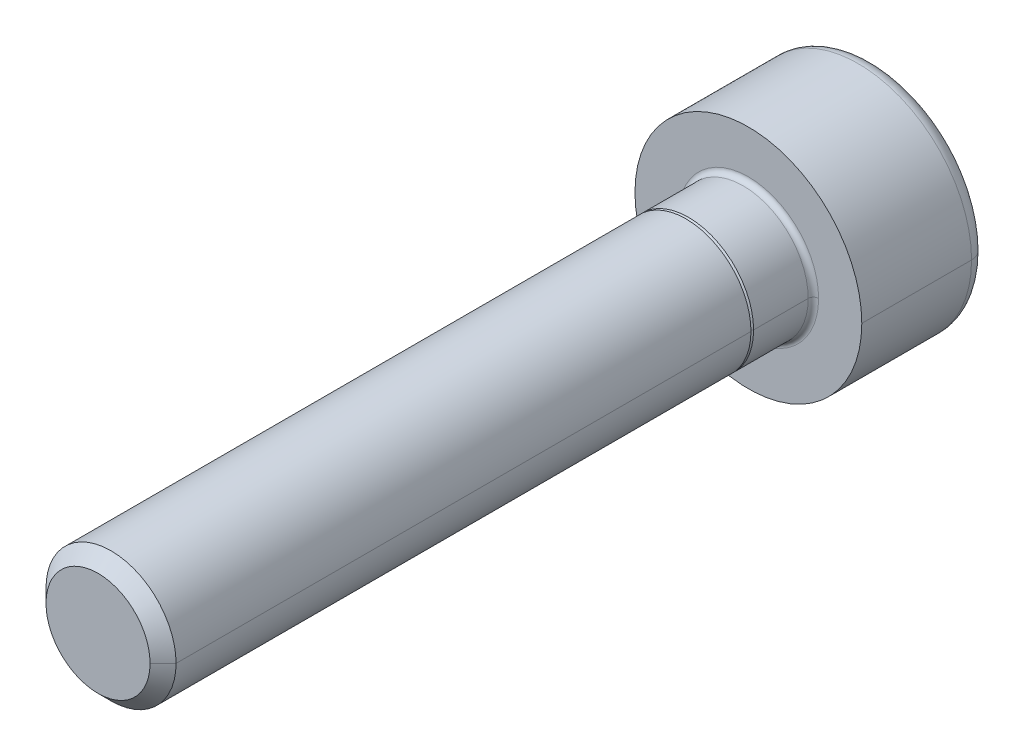
ISO-10303-21;
HEADER;
FILE_DESCRIPTION(('STEP AP214'),'2;1');
FILE_NAME('part.step','',(''),(''),'','','');
FILE_SCHEMA(('AUTOMOTIVE_DESIGN { 1 0 10303 214 1 1 1 1 }'));
ENDSEC;
DATA;
#1=APPLICATION_CONTEXT('core data for automotive mechanical design processes');
#2=APPLICATION_PROTOCOL_DEFINITION('international standard','automotive_design',2000,#1);
#3=PRODUCT_CONTEXT('',#1,'mechanical');
#4=PRODUCT('Part','Part','',(#3));
#5=PRODUCT_RELATED_PRODUCT_CATEGORY('part','',(#4));
#6=PRODUCT_DEFINITION_FORMATION('','',#4);
#7=PRODUCT_DEFINITION_CONTEXT('part definition',#1,'design');
#8=PRODUCT_DEFINITION('design','',#6,#7);
#9=PRODUCT_DEFINITION_SHAPE('','',#8);
#10=(LENGTH_UNIT() NAMED_UNIT(*) SI_UNIT(.MILLI.,.METRE.));
#11=(NAMED_UNIT(*) PLANE_ANGLE_UNIT() SI_UNIT($,.RADIAN.));
#12=(NAMED_UNIT(*) SI_UNIT($,.STERADIAN.) SOLID_ANGLE_UNIT());
#13=UNCERTAINTY_MEASURE_WITH_UNIT(LENGTH_MEASURE(1.E-05),#10,'distance_accuracy_value','');
#14=(GEOMETRIC_REPRESENTATION_CONTEXT(3) GLOBAL_UNCERTAINTY_ASSIGNED_CONTEXT((#13)) GLOBAL_UNIT_ASSIGNED_CONTEXT((#10,
#11,#12)) REPRESENTATION_CONTEXT('',''));
#15=CARTESIAN_POINT('',(0.,0.,0.));
#16=DIRECTION('',(0.,0.,1.));
#17=DIRECTION('',(1.,0.,0.));
#18=AXIS2_PLACEMENT_3D('',#15,#16,#17);
#19=CARTESIAN_POINT('',(0.,0.,-4.22));
#20=DIRECTION('',(0.,0.,1.));
#21=DIRECTION('',(1.,0.,0.));
#22=AXIS2_PLACEMENT_3D('',#19,#20,#21);
#23=TOROIDAL_SURFACE('',#22,3.76,0.6);
#24=CARTESIAN_POINT('',(-3.76,0.,-4.22));
#25=DIRECTION('',(0.,1.,0.));
#26=DIRECTION('',(-1.,0.,0.));
#27=AXIS2_PLACEMENT_3D('',#24,#25,#26);
#28=CIRCLE('',#27,0.6);
#29=CARTESIAN_POINT('',(-3.76,0.,-4.82));
#30=VERTEX_POINT('',#29);
#31=CARTESIAN_POINT('',(-4.36,0.,-4.22));
#32=VERTEX_POINT('',#31);
#33=EDGE_CURVE('E181',#30,#32,#28,.T.);
#34=ORIENTED_EDGE('',*,*,#33,.F.);
#35=CARTESIAN_POINT('',(0.,0.,-4.82));
#36=DIRECTION('',(0.,0.,-1.));
#37=DIRECTION('',(1.,0.,0.));
#38=AXIS2_PLACEMENT_3D('',#35,#36,#37);
#39=CIRCLE('',#38,3.76);
#40=CARTESIAN_POINT('',(3.76,0.,-4.82));
#41=VERTEX_POINT('',#40);
#42=EDGE_CURVE('E168',#41,#30,#39,.T.);
#43=ORIENTED_EDGE('',*,*,#42,.F.);
#44=CARTESIAN_POINT('',(3.76,0.,-4.22));
#45=DIRECTION('',(0.,-1.,0.));
#46=DIRECTION('',(0.,0.,-1.));
#47=AXIS2_PLACEMENT_3D('',#44,#45,#46);
#48=CIRCLE('',#47,0.6);
#49=CARTESIAN_POINT('',(4.36,0.,-4.22));
#50=VERTEX_POINT('',#49);
#51=EDGE_CURVE('E190',#41,#50,#48,.T.);
#52=ORIENTED_EDGE('',*,*,#51,.T.);
#53=CARTESIAN_POINT('',(0.,0.,-4.22));
#54=DIRECTION('',(0.,0.,1.));
#55=DIRECTION('',(1.,0.,0.));
#56=AXIS2_PLACEMENT_3D('',#53,#54,#55);
#57=CIRCLE('',#56,4.36);
#58=EDGE_CURVE('E182',#32,#50,#57,.T.);
#59=ORIENTED_EDGE('',*,*,#58,.F.);
#60=EDGE_LOOP('',(#34,#43,#52,#59));
#61=FACE_BOUND('',#60,.T.);
#62=ADVANCED_FACE('F17',(#61),#23,.T.);
#63=CARTESIAN_POINT('',(0.,0.,0.2));
#64=DIRECTION('',(0.,0.,1.));
#65=DIRECTION('',(1.,0.,0.));
#66=AXIS2_PLACEMENT_3D('',#63,#64,#65);
#67=TOROIDAL_SURFACE('',#66,2.7,0.2);
#68=CARTESIAN_POINT('',(-2.7,0.,0.2));
#69=DIRECTION('',(0.,1.,0.));
#70=DIRECTION('',(-1.,0.,0.));
#71=AXIS2_PLACEMENT_3D('',#68,#69,#70);
#72=CIRCLE('',#71,0.2);
#73=CARTESIAN_POINT('',(-2.5,0.,0.2));
#74=VERTEX_POINT('',#73);
#75=CARTESIAN_POINT('',(-2.7,0.,0.));
#76=VERTEX_POINT('',#75);
#77=EDGE_CURVE('E239',#74,#76,#72,.T.);
#78=ORIENTED_EDGE('',*,*,#77,.F.);
#79=CARTESIAN_POINT('',(0.,0.,0.2));
#80=DIRECTION('',(0.,0.,1.));
#81=DIRECTION('',(1.,0.,0.));
#82=AXIS2_PLACEMENT_3D('',#79,#80,#81);
#83=CIRCLE('',#82,2.5);
#84=CARTESIAN_POINT('',(2.5,0.,0.2));
#85=VERTEX_POINT('',#84);
#86=EDGE_CURVE('E254',#85,#74,#83,.T.);
#87=ORIENTED_EDGE('',*,*,#86,.F.);
#88=CARTESIAN_POINT('',(2.7,0.,0.2));
#89=DIRECTION('',(0.,-1.,0.));
#90=DIRECTION('',(0.,0.,-1.));
#91=AXIS2_PLACEMENT_3D('',#88,#89,#90);
#92=CIRCLE('',#91,0.2);
#93=CARTESIAN_POINT('',(2.7,0.,0.));
#94=VERTEX_POINT('',#93);
#95=EDGE_CURVE('E214',#85,#94,#92,.T.);
#96=ORIENTED_EDGE('',*,*,#95,.T.);
#97=CARTESIAN_POINT('',(0.,0.,0.));
#98=DIRECTION('',(0.,0.,-1.));
#99=DIRECTION('',(1.,0.,0.));
#100=AXIS2_PLACEMENT_3D('',#97,#98,#99);
#101=CIRCLE('',#100,2.7);
#102=EDGE_CURVE('E330',#76,#94,#101,.T.);
#103=ORIENTED_EDGE('',*,*,#102,.F.);
#104=EDGE_LOOP('',(#78,#87,#96,#103));
#105=FACE_BOUND('',#104,.T.);
#106=ADVANCED_FACE('F390',(#105),#67,.F.);
#107=CARTESIAN_POINT('',(0.,0.,25.));
#108=DIRECTION('',(0.,0.,-1.));
#109=DIRECTION('',(-1.,0.,0.));
#110=AXIS2_PLACEMENT_3D('',#107,#108,#109);
#111=CONICAL_SURFACE('',#110,2.,0.785398163397442);
#112=DIRECTION('',(0.707106781186544,0.,-0.707106781186552));
#113=VECTOR('',#112,1.);
#114=CARTESIAN_POINT('',(2.,0.,25.));
#115=LINE('',#114,#113);
#116=CARTESIAN_POINT('',(2.,0.,25.));
#117=VERTEX_POINT('',#116);
#118=CARTESIAN_POINT('',(2.5,0.,24.5));
#119=VERTEX_POINT('',#118);
#120=EDGE_CURVE('E229',#117,#119,#115,.T.);
#121=ORIENTED_EDGE('',*,*,#120,.F.);
#122=CARTESIAN_POINT('',(0.,0.,25.));
#123=DIRECTION('',(0.,0.,1.));
#124=DIRECTION('',(1.,0.,0.));
#125=AXIS2_PLACEMENT_3D('',#122,#123,#124);
#126=CIRCLE('',#125,2.);
#127=CARTESIAN_POINT('',(-2.,0.,25.));
#128=VERTEX_POINT('',#127);
#129=EDGE_CURVE('E11',#128,#117,#126,.T.);
#130=ORIENTED_EDGE('',*,*,#129,.F.);
#131=DIRECTION('',(-0.707106781186544,0.,-0.707106781186552));
#132=VECTOR('',#131,1.);
#133=CARTESIAN_POINT('',(-2.,0.,25.));
#134=LINE('',#133,#132);
#135=CARTESIAN_POINT('',(-2.5,0.,24.5));
#136=VERTEX_POINT('',#135);
#137=EDGE_CURVE('E199',#128,#136,#134,.T.);
#138=ORIENTED_EDGE('',*,*,#137,.T.);
#139=CARTESIAN_POINT('',(0.,0.,24.5));
#140=DIRECTION('',(0.,0.,-1.));
#141=DIRECTION('',(1.,0.,0.));
#142=AXIS2_PLACEMENT_3D('',#139,#140,#141);
#143=CIRCLE('',#142,2.5);
#144=EDGE_CURVE('E353',#119,#136,#143,.T.);
#145=ORIENTED_EDGE('',*,*,#144,.F.);
#146=EDGE_LOOP('',(#121,#130,#138,#145));
#147=FACE_BOUND('',#146,.T.);
#148=ADVANCED_FACE('F375',(#147),#111,.T.);
#149=CARTESIAN_POINT('',(0.,0.,2.4));
#150=DIRECTION('',(0.,0.,1.));
#151=DIRECTION('',(1.,0.,0.));
#152=AXIS2_PLACEMENT_3D('',#149,#150,#151);
#153=PLANE('',#152);
#154=CARTESIAN_POINT('',(0.,0.,2.4));
#155=DIRECTION('',(0.,0.,1.));
#156=DIRECTION('',(1.,0.,0.));
#157=AXIS2_PLACEMENT_3D('',#154,#155,#156);
#158=CIRCLE('',#157,2.4);
#159=CARTESIAN_POINT('',(-2.4,0.,2.4));
#160=VERTEX_POINT('',#159);
#161=CARTESIAN_POINT('',(2.4,0.,2.4));
#162=VERTEX_POINT('',#161);
#163=EDGE_CURVE('E283',#160,#162,#158,.T.);
#164=ORIENTED_EDGE('',*,*,#163,.T.);
#165=CARTESIAN_POINT('',(0.,0.,2.4));
#166=DIRECTION('',(0.,0.,1.));
#167=DIRECTION('',(1.,0.,0.));
#168=AXIS2_PLACEMENT_3D('',#165,#166,#167);
#169=CIRCLE('',#168,2.4);
#170=EDGE_CURVE('E249',#162,#160,#169,.T.);
#171=ORIENTED_EDGE('',*,*,#170,.T.);
#172=EDGE_LOOP('',(#164,#171));
#173=FACE_BOUND('',#172,.T.);
#174=CARTESIAN_POINT('',(0.,0.,2.4));
#175=DIRECTION('',(0.,0.,1.));
#176=DIRECTION('',(1.,0.,0.));
#177=AXIS2_PLACEMENT_3D('',#174,#175,#176);
#178=CIRCLE('',#177,2.5);
#179=CARTESIAN_POINT('',(-2.5,0.,2.4));
#180=VERTEX_POINT('',#179);
#181=CARTESIAN_POINT('',(2.5,0.,2.4));
#182=VERTEX_POINT('',#181);
#183=EDGE_CURVE('E25',#180,#182,#178,.T.);
#184=ORIENTED_EDGE('',*,*,#183,.F.);
#185=CARTESIAN_POINT('',(0.,0.,2.4));
#186=DIRECTION('',(0.,0.,1.));
#187=DIRECTION('',(1.,0.,0.));
#188=AXIS2_PLACEMENT_3D('',#185,#186,#187);
#189=CIRCLE('',#188,2.5);
#190=EDGE_CURVE('E210',#182,#180,#189,.T.);
#191=ORIENTED_EDGE('',*,*,#190,.F.);
#192=EDGE_LOOP('',(#184,#191));
#193=FACE_BOUND('',#192,.T.);
#194=ADVANCED_FACE('F365',(#173,#193),#153,.F.);
#195=CARTESIAN_POINT('',(0.,0.,25.));
#196=DIRECTION('',(0.,0.,1.));
#197=DIRECTION('',(1.,0.,0.));
#198=AXIS2_PLACEMENT_3D('',#195,#196,#197);
#199=PLANE('',#198);
#200=ORIENTED_EDGE('',*,*,#129,.T.);
#201=CARTESIAN_POINT('',(0.,0.,25.));
#202=DIRECTION('',(0.,0.,1.));
#203=DIRECTION('',(1.,0.,0.));
#204=AXIS2_PLACEMENT_3D('',#201,#202,#203);
#205=CIRCLE('',#204,2.);
#206=EDGE_CURVE('E218',#117,#128,#205,.T.);
#207=ORIENTED_EDGE('',*,*,#206,.T.);
#208=EDGE_LOOP('',(#200,#207));
#209=FACE_BOUND('',#208,.T.);
#210=ADVANCED_FACE('F377',(#209),#199,.T.);
#211=CARTESIAN_POINT('',(0.,0.,25.));
#212=DIRECTION('',(0.,0.,-1.));
#213=DIRECTION('',(-1.,0.,0.));
#214=AXIS2_PLACEMENT_3D('',#211,#212,#213);
#215=CYLINDRICAL_SURFACE('',#214,2.5);
#216=DIRECTION('',(0.,0.,-1.));
#217=VECTOR('',#216,1.);
#218=CARTESIAN_POINT('',(2.5,0.,25.));
#219=LINE('',#218,#217);
#220=EDGE_CURVE('E203',#119,#182,#219,.T.);
#221=ORIENTED_EDGE('',*,*,#220,.F.);
#222=ORIENTED_EDGE('',*,*,#144,.T.);
#223=DIRECTION('',(0.,0.,-1.));
#224=VECTOR('',#223,1.);
#225=CARTESIAN_POINT('',(-2.5,0.,25.));
#226=LINE('',#225,#224);
#227=EDGE_CURVE('E197',#136,#180,#226,.T.);
#228=ORIENTED_EDGE('',*,*,#227,.T.);
#229=ORIENTED_EDGE('',*,*,#183,.T.);
#230=EDGE_LOOP('',(#221,#222,#228,#229));
#231=FACE_BOUND('',#230,.T.);
#232=ADVANCED_FACE('F362',(#231),#215,.T.);
#233=CARTESIAN_POINT('',(0.,0.,2.4));
#234=DIRECTION('',(0.,0.,-1.));
#235=DIRECTION('',(-1.,0.,0.));
#236=AXIS2_PLACEMENT_3D('',#233,#234,#235);
#237=CONICAL_SURFACE('',#236,2.4,0.785398163397442);
#238=DIRECTION('',(0.707106781186543,0.,-0.707106781186552));
#239=VECTOR('',#238,1.);
#240=CARTESIAN_POINT('',(2.4,0.,2.4));
#241=LINE('',#240,#239);
#242=CARTESIAN_POINT('',(2.5,0.,2.3));
#243=VERTEX_POINT('',#242);
#244=EDGE_CURVE('E253',#162,#243,#241,.T.);
#245=ORIENTED_EDGE('',*,*,#244,.F.);
#246=ORIENTED_EDGE('',*,*,#163,.F.);
#247=DIRECTION('',(-0.707106781186543,0.,-0.707106781186552));
#248=VECTOR('',#247,1.);
#249=CARTESIAN_POINT('',(-2.4,0.,2.4));
#250=LINE('',#249,#248);
#251=CARTESIAN_POINT('',(-2.5,0.,2.3));
#252=VERTEX_POINT('',#251);
#253=EDGE_CURVE('E267',#160,#252,#250,.T.);
#254=ORIENTED_EDGE('',*,*,#253,.T.);
#255=CARTESIAN_POINT('',(0.,0.,2.3));
#256=DIRECTION('',(0.,0.,-1.));
#257=DIRECTION('',(1.,0.,0.));
#258=AXIS2_PLACEMENT_3D('',#255,#256,#257);
#259=CIRCLE('',#258,2.5);
#260=EDGE_CURVE('E280',#243,#252,#259,.T.);
#261=ORIENTED_EDGE('',*,*,#260,.F.);
#262=EDGE_LOOP('',(#245,#246,#254,#261));
#263=FACE_BOUND('',#262,.T.);
#264=ADVANCED_FACE('F385',(#263),#237,.T.);
#265=CARTESIAN_POINT('',(0.,0.,2.4));
#266=DIRECTION('',(0.,0.,-1.));
#267=DIRECTION('',(-1.,0.,0.));
#268=AXIS2_PLACEMENT_3D('',#265,#266,#267);
#269=CYLINDRICAL_SURFACE('',#268,2.5);
#270=DIRECTION('',(0.,0.,-1.));
#271=VECTOR('',#270,1.);
#272=CARTESIAN_POINT('',(2.5,0.,2.4));
#273=LINE('',#272,#271);
#274=EDGE_CURVE('E259',#243,#85,#273,.T.);
#275=ORIENTED_EDGE('',*,*,#274,.F.);
#276=ORIENTED_EDGE('',*,*,#260,.T.);
#277=DIRECTION('',(0.,0.,-1.));
#278=VECTOR('',#277,1.);
#279=CARTESIAN_POINT('',(-2.5,0.,2.4));
#280=LINE('',#279,#278);
#281=EDGE_CURVE('E258',#252,#74,#280,.T.);
#282=ORIENTED_EDGE('',*,*,#281,.T.);
#283=CARTESIAN_POINT('',(0.,0.,0.2));
#284=DIRECTION('',(0.,0.,1.));
#285=DIRECTION('',(1.,0.,0.));
#286=AXIS2_PLACEMENT_3D('',#283,#284,#285);
#287=CIRCLE('',#286,2.5);
#288=EDGE_CURVE('E225',#74,#85,#287,.T.);
#289=ORIENTED_EDGE('',*,*,#288,.T.);
#290=EDGE_LOOP('',(#275,#276,#282,#289));
#291=FACE_BOUND('',#290,.T.);
#292=ADVANCED_FACE('F407',(#291),#269,.T.);
#293=CARTESIAN_POINT('',(0.,0.,-2.32));
#294=DIRECTION('',(0.,0.,-1.));
#295=DIRECTION('',(0.,-1.,0.));
#296=AXIS2_PLACEMENT_3D('',#293,#294,#295);
#297=PLANE('',#296);
#298=DIRECTION('',(-0.5,-0.866025403784439,0.));
#299=VECTOR('',#298,1.);
#300=CARTESIAN_POINT('',(2.64426423288849,0.,-2.32));
#301=LINE('',#300,#299);
#302=CARTESIAN_POINT('',(2.64426423288849,0.,-2.32));
#303=VERTEX_POINT('',#302);
#304=CARTESIAN_POINT('',(1.32213211644424,-2.29,-2.32));
#305=VERTEX_POINT('',#304);
#306=EDGE_CURVE('E209',#303,#305,#301,.T.);
#307=ORIENTED_EDGE('',*,*,#306,.T.);
#308=DIRECTION('',(-1.,0.,0.));
#309=VECTOR('',#308,1.);
#310=CARTESIAN_POINT('',(1.32213211644424,-2.29,-2.32));
#311=LINE('',#310,#309);
#312=CARTESIAN_POINT('',(-1.32213211644424,-2.29,-2.32));
#313=VERTEX_POINT('',#312);
#314=EDGE_CURVE('E38',#305,#313,#311,.T.);
#315=ORIENTED_EDGE('',*,*,#314,.T.);
#316=DIRECTION('',(-0.5,0.866025403784439,0.));
#317=VECTOR('',#316,1.);
#318=CARTESIAN_POINT('',(-1.32213211644424,-2.29,-2.32));
#319=LINE('',#318,#317);
#320=CARTESIAN_POINT('',(-2.64426423288848,0.,-2.32));
#321=VERTEX_POINT('',#320);
#322=EDGE_CURVE('E46',#313,#321,#319,.T.);
#323=ORIENTED_EDGE('',*,*,#322,.T.);
#324=DIRECTION('',(0.5,0.866025403784438,0.));
#325=VECTOR('',#324,1.);
#326=CARTESIAN_POINT('',(-2.64426423288848,0.,-2.32));
#327=LINE('',#326,#325);
#328=CARTESIAN_POINT('',(-1.32213211644424,2.29,-2.32));
#329=VERTEX_POINT('',#328);
#330=EDGE_CURVE('E318',#321,#329,#327,.T.);
#331=ORIENTED_EDGE('',*,*,#330,.T.);
#332=DIRECTION('',(1.,0.,0.));
#333=VECTOR('',#332,1.);
#334=CARTESIAN_POINT('',(-1.32213211644424,2.29,-2.32));
#335=LINE('',#334,#333);
#336=CARTESIAN_POINT('',(1.32213211644425,2.29,-2.32));
#337=VERTEX_POINT('',#336);
#338=EDGE_CURVE('E322',#329,#337,#335,.T.);
#339=ORIENTED_EDGE('',*,*,#338,.T.);
#340=DIRECTION('',(0.5,-0.866025403784439,0.));
#341=VECTOR('',#340,1.);
#342=CARTESIAN_POINT('',(1.32213211644425,2.29,-2.32));
#343=LINE('',#342,#341);
#344=EDGE_CURVE('E208',#337,#303,#343,.T.);
#345=ORIENTED_EDGE('',*,*,#344,.T.);
#346=EDGE_LOOP('',(#307,#315,#323,#331,#339,#345));
#347=FACE_BOUND('',#346,.T.);
#348=ADVANCED_FACE('F423',(#347),#297,.T.);
#349=CARTESIAN_POINT('',(1.32213211644424,-2.29,-2.32));
#350=DIRECTION('',(0.,-1.,0.));
#351=DIRECTION('',(-1.,0.,0.));
#352=AXIS2_PLACEMENT_3D('',#349,#350,#351);
#353=PLANE('',#352);
#354=DIRECTION('',(-1.,0.,0.));
#355=VECTOR('',#354,1.);
#356=CARTESIAN_POINT('',(1.32213211644424,-2.29,-4.82));
#357=LINE('',#356,#355);
#358=CARTESIAN_POINT('',(1.32213211644424,-2.29,-4.82));
#359=VERTEX_POINT('',#358);
#360=CARTESIAN_POINT('',(-1.32213211644424,-2.29,-4.82));
#361=VERTEX_POINT('',#360);
#362=EDGE_CURVE('E177',#359,#361,#357,.T.);
#363=ORIENTED_EDGE('',*,*,#362,.T.);
#364=DIRECTION('',(0.,0.,-1.));
#365=VECTOR('',#364,1.);
#366=CARTESIAN_POINT('',(-1.32213211644424,-2.29,-2.32));
#367=LINE('',#366,#365);
#368=EDGE_CURVE('E346',#313,#361,#367,.T.);
#369=ORIENTED_EDGE('',*,*,#368,.F.);
#370=ORIENTED_EDGE('',*,*,#314,.F.);
#371=DIRECTION('',(0.,0.,-1.));
#372=VECTOR('',#371,1.);
#373=CARTESIAN_POINT('',(1.32213211644424,-2.29,-2.32));
#374=LINE('',#373,#372);
#375=EDGE_CURVE('E333',#305,#359,#374,.T.);
#376=ORIENTED_EDGE('',*,*,#375,.T.);
#377=EDGE_LOOP('',(#363,#369,#370,#376));
#378=FACE_BOUND('',#377,.T.);
#379=ADVANCED_FACE('F428',(#378),#353,.F.);
#380=CARTESIAN_POINT('',(-1.32213211644424,-2.29,-2.32));
#381=DIRECTION('',(-0.866025403784439,-0.5,0.));
#382=DIRECTION('',(-0.5,0.866025403784439,0.));
#383=AXIS2_PLACEMENT_3D('',#380,#381,#382);
#384=PLANE('',#383);
#385=DIRECTION('',(-0.5,0.866025403784439,0.));
#386=VECTOR('',#385,1.);
#387=CARTESIAN_POINT('',(-1.32213211644424,-2.29,-4.82));
#388=LINE('',#387,#386);
#389=CARTESIAN_POINT('',(-2.64426423288848,0.,-4.82));
#390=VERTEX_POINT('',#389);
#391=EDGE_CURVE('E326',#361,#390,#388,.T.);
#392=ORIENTED_EDGE('',*,*,#391,.T.);
#393=DIRECTION('',(0.,0.,-1.));
#394=VECTOR('',#393,1.);
#395=CARTESIAN_POINT('',(-2.64426423288848,0.,-2.32));
#396=LINE('',#395,#394);
#397=EDGE_CURVE('E315',#321,#390,#396,.T.);
#398=ORIENTED_EDGE('',*,*,#397,.F.);
#399=ORIENTED_EDGE('',*,*,#322,.F.);
#400=ORIENTED_EDGE('',*,*,#368,.T.);
#401=EDGE_LOOP('',(#392,#398,#399,#400));
#402=FACE_BOUND('',#401,.T.);
#403=ADVANCED_FACE('F431',(#402),#384,.F.);
#404=CARTESIAN_POINT('',(-2.64426423288848,0.,-2.32));
#405=DIRECTION('',(-0.866025403784438,0.5,0.));
#406=DIRECTION('',(0.,0.,1.));
#407=AXIS2_PLACEMENT_3D('',#404,#405,#406);
#408=PLANE('',#407);
#409=DIRECTION('',(0.5,0.866025403784438,0.));
#410=VECTOR('',#409,1.);
#411=CARTESIAN_POINT('',(-2.64426423288848,0.,-4.82));
#412=LINE('',#411,#410);
#413=CARTESIAN_POINT('',(-1.32213211644424,2.29,-4.82));
#414=VERTEX_POINT('',#413);
#415=EDGE_CURVE('E288',#390,#414,#412,.T.);
#416=ORIENTED_EDGE('',*,*,#415,.T.);
#417=DIRECTION('',(0.,0.,-1.));
#418=VECTOR('',#417,1.);
#419=CARTESIAN_POINT('',(-1.32213211644424,2.29,-2.32));
#420=LINE('',#419,#418);
#421=EDGE_CURVE('E319',#329,#414,#420,.T.);
#422=ORIENTED_EDGE('',*,*,#421,.F.);
#423=ORIENTED_EDGE('',*,*,#330,.F.);
#424=ORIENTED_EDGE('',*,*,#397,.T.);
#425=EDGE_LOOP('',(#416,#422,#423,#424));
#426=FACE_BOUND('',#425,.T.);
#427=ADVANCED_FACE('F435',(#426),#408,.F.);
#428=CARTESIAN_POINT('',(-1.32213211644424,2.29,-2.32));
#429=DIRECTION('',(0.,1.,0.));
#430=DIRECTION('',(1.,0.,0.));
#431=AXIS2_PLACEMENT_3D('',#428,#429,#430);
#432=PLANE('',#431);
#433=DIRECTION('',(1.,0.,0.));
#434=VECTOR('',#433,1.);
#435=CARTESIAN_POINT('',(-1.32213211644424,2.29,-4.82));
#436=LINE('',#435,#434);
#437=CARTESIAN_POINT('',(1.32213211644425,2.29,-4.82));
#438=VERTEX_POINT('',#437);
#439=EDGE_CURVE('E284',#414,#438,#436,.T.);
#440=ORIENTED_EDGE('',*,*,#439,.T.);
#441=DIRECTION('',(0.,0.,-1.));
#442=VECTOR('',#441,1.);
#443=CARTESIAN_POINT('',(1.32213211644425,2.29,-2.32));
#444=LINE('',#443,#442);
#445=EDGE_CURVE('E273',#337,#438,#444,.T.);
#446=ORIENTED_EDGE('',*,*,#445,.F.);
#447=ORIENTED_EDGE('',*,*,#338,.F.);
#448=ORIENTED_EDGE('',*,*,#421,.T.);
#449=EDGE_LOOP('',(#440,#446,#447,#448));
#450=FACE_BOUND('',#449,.T.);
#451=ADVANCED_FACE('F441',(#450),#432,.F.);
#452=CARTESIAN_POINT('',(1.32213211644425,2.29,-2.32));
#453=DIRECTION('',(0.866025403784439,0.5,0.));
#454=DIRECTION('',(0.,0.,-1.));
#455=AXIS2_PLACEMENT_3D('',#452,#453,#454);
#456=PLANE('',#455);
#457=DIRECTION('',(0.5,-0.866025403784439,0.));
#458=VECTOR('',#457,1.);
#459=CARTESIAN_POINT('',(1.32213211644425,2.29,-4.82));
#460=LINE('',#459,#458);
#461=CARTESIAN_POINT('',(2.64426423288849,0.,-4.82));
#462=VERTEX_POINT('',#461);
#463=EDGE_CURVE('E289',#438,#462,#460,.T.);
#464=ORIENTED_EDGE('',*,*,#463,.T.);
#465=DIRECTION('',(0.,0.,-1.));
#466=VECTOR('',#465,1.);
#467=CARTESIAN_POINT('',(2.64426423288849,0.,-2.32));
#468=LINE('',#467,#466);
#469=EDGE_CURVE('E205',#303,#462,#468,.T.);
#470=ORIENTED_EDGE('',*,*,#469,.F.);
#471=ORIENTED_EDGE('',*,*,#344,.F.);
#472=ORIENTED_EDGE('',*,*,#445,.T.);
#473=EDGE_LOOP('',(#464,#470,#471,#472));
#474=FACE_BOUND('',#473,.T.);
#475=ADVANCED_FACE('F437',(#474),#456,.F.);
#476=CARTESIAN_POINT('',(2.64426423288849,0.,-2.32));
#477=DIRECTION('',(0.866025403784439,-0.5,0.));
#478=DIRECTION('',(0.,0.,-1.));
#479=AXIS2_PLACEMENT_3D('',#476,#477,#478);
#480=PLANE('',#479);
#481=DIRECTION('',(-0.5,-0.866025403784439,0.));
#482=VECTOR('',#481,1.);
#483=CARTESIAN_POINT('',(2.64426423288849,0.,-4.82));
#484=LINE('',#483,#482);
#485=EDGE_CURVE('E308',#462,#359,#484,.T.);
#486=ORIENTED_EDGE('',*,*,#485,.T.);
#487=ORIENTED_EDGE('',*,*,#375,.F.);
#488=ORIENTED_EDGE('',*,*,#306,.F.);
#489=ORIENTED_EDGE('',*,*,#469,.T.);
#490=EDGE_LOOP('',(#486,#487,#488,#489));
#491=FACE_BOUND('',#490,.T.);
#492=ADVANCED_FACE('F440',(#491),#480,.F.);
#493=CARTESIAN_POINT('',(0.,0.,0.));
#494=DIRECTION('',(0.,0.,1.));
#495=DIRECTION('',(1.,0.,0.));
#496=AXIS2_PLACEMENT_3D('',#493,#494,#495);
#497=PLANE('',#496);
#498=CARTESIAN_POINT('',(0.,0.,0.));
#499=DIRECTION('',(0.,0.,-1.));
#500=DIRECTION('',(1.,0.,0.));
#501=AXIS2_PLACEMENT_3D('',#498,#499,#500);
#502=CIRCLE('',#501,2.7);
#503=EDGE_CURVE('E219',#94,#76,#502,.T.);
#504=ORIENTED_EDGE('',*,*,#503,.T.);
#505=ORIENTED_EDGE('',*,*,#102,.T.);
#506=EDGE_LOOP('',(#504,#505));
#507=FACE_BOUND('',#506,.T.);
#508=CARTESIAN_POINT('',(0.,0.,0.));
#509=DIRECTION('',(0.,0.,1.));
#510=DIRECTION('',(1.,0.,0.));
#511=AXIS2_PLACEMENT_3D('',#508,#509,#510);
#512=CIRCLE('',#511,4.36);
#513=CARTESIAN_POINT('',(4.36,0.,0.));
#514=VERTEX_POINT('',#513);
#515=CARTESIAN_POINT('',(-4.36,0.,0.));
#516=VERTEX_POINT('',#515);
#517=EDGE_CURVE('E293',#514,#516,#512,.T.);
#518=ORIENTED_EDGE('',*,*,#517,.T.);
#519=CARTESIAN_POINT('',(0.,0.,0.));
#520=DIRECTION('',(0.,0.,1.));
#521=DIRECTION('',(1.,0.,0.));
#522=AXIS2_PLACEMENT_3D('',#519,#520,#521);
#523=CIRCLE('',#522,4.36);
#524=EDGE_CURVE('E178',#516,#514,#523,.T.);
#525=ORIENTED_EDGE('',*,*,#524,.T.);
#526=EDGE_LOOP('',(#518,#525));
#527=FACE_BOUND('',#526,.T.);
#528=ADVANCED_FACE('F443',(#507,#527),#497,.T.);
#529=CARTESIAN_POINT('',(0.,0.,-4.82));
#530=DIRECTION('',(0.,0.,1.));
#531=DIRECTION('',(1.,0.,0.));
#532=AXIS2_PLACEMENT_3D('',#529,#530,#531);
#533=PLANE('',#532);
#534=ORIENTED_EDGE('',*,*,#362,.F.);
#535=ORIENTED_EDGE('',*,*,#485,.F.);
#536=ORIENTED_EDGE('',*,*,#463,.F.);
#537=ORIENTED_EDGE('',*,*,#439,.F.);
#538=ORIENTED_EDGE('',*,*,#415,.F.);
#539=ORIENTED_EDGE('',*,*,#391,.F.);
#540=EDGE_LOOP('',(#534,#535,#536,#537,#538,#539));
#541=FACE_BOUND('',#540,.T.);
#542=ORIENTED_EDGE('',*,*,#42,.T.);
#543=CARTESIAN_POINT('',(0.,0.,-4.82));
#544=DIRECTION('',(0.,0.,-1.));
#545=DIRECTION('',(1.,0.,0.));
#546=AXIS2_PLACEMENT_3D('',#543,#544,#545);
#547=CIRCLE('',#546,3.76);
#548=EDGE_CURVE('E172',#30,#41,#547,.T.);
#549=ORIENTED_EDGE('',*,*,#548,.T.);
#550=EDGE_LOOP('',(#542,#549));
#551=FACE_BOUND('',#550,.T.);
#552=ADVANCED_FACE('F170',(#541,#551),#533,.F.);
#553=CARTESIAN_POINT('',(0.,0.,-4.82));
#554=DIRECTION('',(0.,0.,1.));
#555=DIRECTION('',(1.,0.,0.));
#556=AXIS2_PLACEMENT_3D('',#553,#554,#555);
#557=CYLINDRICAL_SURFACE('',#556,4.36);
#558=DIRECTION('',(0.,0.,1.));
#559=VECTOR('',#558,1.);
#560=CARTESIAN_POINT('',(-4.36,0.,-4.82));
#561=LINE('',#560,#559);
#562=EDGE_CURVE('E279',#32,#516,#561,.T.);
#563=ORIENTED_EDGE('',*,*,#562,.F.);
#564=ORIENTED_EDGE('',*,*,#58,.T.);
#565=DIRECTION('',(0.,0.,1.));
#566=VECTOR('',#565,1.);
#567=CARTESIAN_POINT('',(4.36,0.,-4.82));
#568=LINE('',#567,#566);
#569=EDGE_CURVE('E297',#50,#514,#568,.T.);
#570=ORIENTED_EDGE('',*,*,#569,.T.);
#571=ORIENTED_EDGE('',*,*,#524,.F.);
#572=EDGE_LOOP('',(#563,#564,#570,#571));
#573=FACE_BOUND('',#572,.T.);
#574=ADVANCED_FACE('F450',(#573),#557,.T.);
#575=CARTESIAN_POINT('',(0.,0.,-4.82));
#576=DIRECTION('',(0.,0.,1.));
#577=DIRECTION('',(1.,0.,0.));
#578=AXIS2_PLACEMENT_3D('',#575,#576,#577);
#579=CYLINDRICAL_SURFACE('',#578,4.36);
#580=CARTESIAN_POINT('',(0.,0.,-4.22));
#581=DIRECTION('',(0.,0.,1.));
#582=DIRECTION('',(1.,0.,0.));
#583=AXIS2_PLACEMENT_3D('',#580,#581,#582);
#584=CIRCLE('',#583,4.36);
#585=EDGE_CURVE('E187',#50,#32,#584,.T.);
#586=ORIENTED_EDGE('',*,*,#585,.T.);
#587=ORIENTED_EDGE('',*,*,#562,.T.);
#588=ORIENTED_EDGE('',*,*,#517,.F.);
#589=ORIENTED_EDGE('',*,*,#569,.F.);
#590=EDGE_LOOP('',(#586,#587,#588,#589));
#591=FACE_BOUND('',#590,.T.);
#592=ADVANCED_FACE('F453',(#591),#579,.T.);
#593=CARTESIAN_POINT('',(0.,0.,2.4));
#594=DIRECTION('',(0.,0.,-1.));
#595=DIRECTION('',(-1.,0.,0.));
#596=AXIS2_PLACEMENT_3D('',#593,#594,#595);
#597=CYLINDRICAL_SURFACE('',#596,2.5);
#598=CARTESIAN_POINT('',(0.,0.,2.3));
#599=DIRECTION('',(0.,0.,-1.));
#600=DIRECTION('',(1.,0.,0.));
#601=AXIS2_PLACEMENT_3D('',#598,#599,#600);
#602=CIRCLE('',#601,2.5);
#603=EDGE_CURVE('E263',#252,#243,#602,.T.);
#604=ORIENTED_EDGE('',*,*,#603,.T.);
#605=ORIENTED_EDGE('',*,*,#274,.T.);
#606=ORIENTED_EDGE('',*,*,#86,.T.);
#607=ORIENTED_EDGE('',*,*,#281,.F.);
#608=EDGE_LOOP('',(#604,#605,#606,#607));
#609=FACE_BOUND('',#608,.T.);
#610=ADVANCED_FACE('F410',(#609),#597,.T.);
#611=CARTESIAN_POINT('',(0.,0.,2.4));
#612=DIRECTION('',(0.,0.,-1.));
#613=DIRECTION('',(-1.,0.,0.));
#614=AXIS2_PLACEMENT_3D('',#611,#612,#613);
#615=CONICAL_SURFACE('',#614,2.4,0.785398163397442);
#616=ORIENTED_EDGE('',*,*,#170,.F.);
#617=ORIENTED_EDGE('',*,*,#244,.T.);
#618=ORIENTED_EDGE('',*,*,#603,.F.);
#619=ORIENTED_EDGE('',*,*,#253,.F.);
#620=EDGE_LOOP('',(#616,#617,#618,#619));
#621=FACE_BOUND('',#620,.T.);
#622=ADVANCED_FACE('F416',(#621),#615,.T.);
#623=CARTESIAN_POINT('',(0.,0.,25.));
#624=DIRECTION('',(0.,0.,-1.));
#625=DIRECTION('',(-1.,0.,0.));
#626=AXIS2_PLACEMENT_3D('',#623,#624,#625);
#627=CYLINDRICAL_SURFACE('',#626,2.5);
#628=CARTESIAN_POINT('',(0.,0.,24.5));
#629=DIRECTION('',(0.,0.,-1.));
#630=DIRECTION('',(1.,0.,0.));
#631=AXIS2_PLACEMENT_3D('',#628,#629,#630);
#632=CIRCLE('',#631,2.5);
#633=EDGE_CURVE('E204',#136,#119,#632,.T.);
#634=ORIENTED_EDGE('',*,*,#633,.T.);
#635=ORIENTED_EDGE('',*,*,#220,.T.);
#636=ORIENTED_EDGE('',*,*,#190,.T.);
#637=ORIENTED_EDGE('',*,*,#227,.F.);
#638=EDGE_LOOP('',(#634,#635,#636,#637));
#639=FACE_BOUND('',#638,.T.);
#640=ADVANCED_FACE('F367',(#639),#627,.T.);
#641=CARTESIAN_POINT('',(0.,0.,25.));
#642=DIRECTION('',(0.,0.,-1.));
#643=DIRECTION('',(-1.,0.,0.));
#644=AXIS2_PLACEMENT_3D('',#641,#642,#643);
#645=CONICAL_SURFACE('',#644,2.,0.785398163397442);
#646=ORIENTED_EDGE('',*,*,#206,.F.);
#647=ORIENTED_EDGE('',*,*,#120,.T.);
#648=ORIENTED_EDGE('',*,*,#633,.F.);
#649=ORIENTED_EDGE('',*,*,#137,.F.);
#650=EDGE_LOOP('',(#646,#647,#648,#649));
#651=FACE_BOUND('',#650,.T.);
#652=ADVANCED_FACE('F373',(#651),#645,.T.);
#653=CARTESIAN_POINT('',(0.,0.,0.2));
#654=DIRECTION('',(0.,0.,1.));
#655=DIRECTION('',(1.,0.,0.));
#656=AXIS2_PLACEMENT_3D('',#653,#654,#655);
#657=TOROIDAL_SURFACE('',#656,2.7,0.2);
#658=ORIENTED_EDGE('',*,*,#288,.F.);
#659=ORIENTED_EDGE('',*,*,#77,.T.);
#660=ORIENTED_EDGE('',*,*,#503,.F.);
#661=ORIENTED_EDGE('',*,*,#95,.F.);
#662=EDGE_LOOP('',(#658,#659,#660,#661));
#663=FACE_BOUND('',#662,.T.);
#664=ADVANCED_FACE('F404',(#663),#657,.F.);
#665=CARTESIAN_POINT('',(0.,0.,-4.22));
#666=DIRECTION('',(0.,0.,1.));
#667=DIRECTION('',(1.,0.,0.));
#668=AXIS2_PLACEMENT_3D('',#665,#666,#667);
#669=TOROIDAL_SURFACE('',#668,3.76,0.6);
#670=ORIENTED_EDGE('',*,*,#548,.F.);
#671=ORIENTED_EDGE('',*,*,#33,.T.);
#672=ORIENTED_EDGE('',*,*,#585,.F.);
#673=ORIENTED_EDGE('',*,*,#51,.F.);
#674=EDGE_LOOP('',(#670,#671,#672,#673));
#675=FACE_BOUND('',#674,.T.);
#676=ADVANCED_FACE('F189',(#675),#669,.T.);
#677=CLOSED_SHELL('',(#62,#106,#148,#194,#210,#232,#264,#292,#348,#379,#403,#427,#451,#475,#492,
#528,#552,#574,#592,#610,#622,#640,#652,#664,#676));
#678=MANIFOLD_SOLID_BREP('B1',#677);
#679=ADVANCED_BREP_SHAPE_REPRESENTATION('',(#18,#678),#14);
#680=SHAPE_DEFINITION_REPRESENTATION(#9,#679);
ENDSEC;
END-ISO-10303-21;
